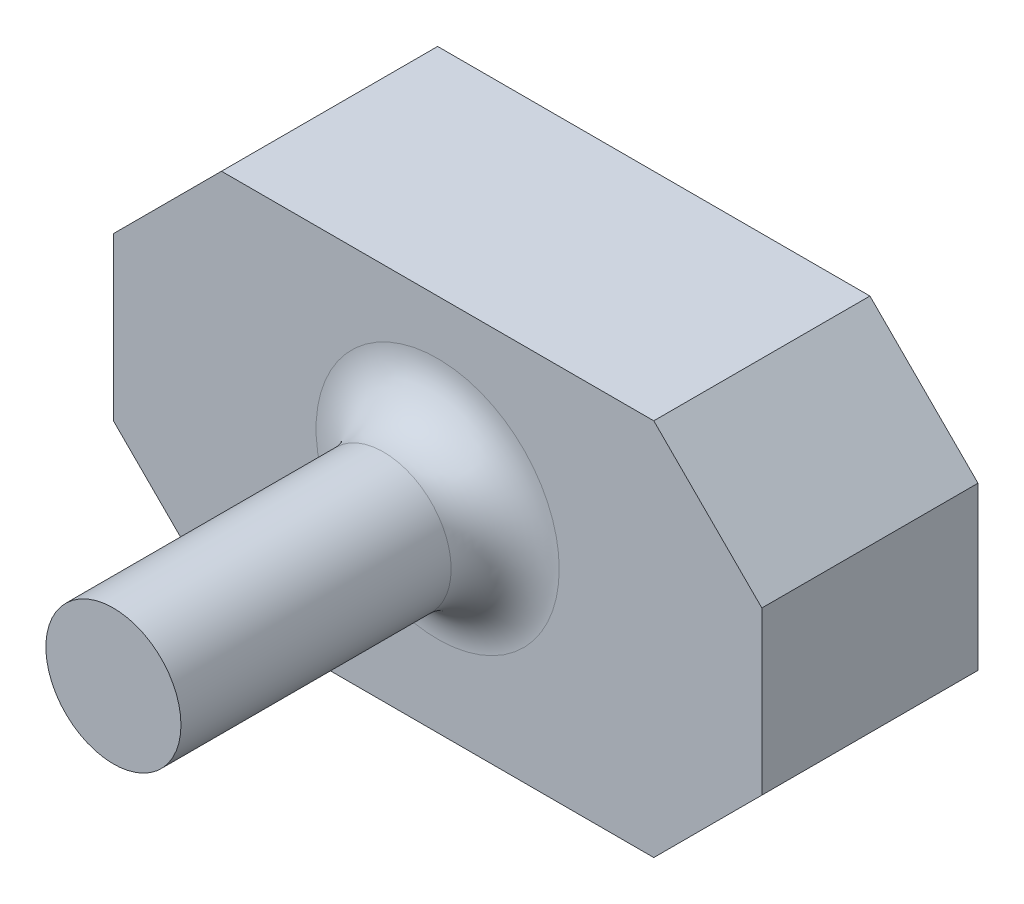
ISO-10303-21;
HEADER;
FILE_DESCRIPTION(('STEP AP214'),'2;1');
FILE_NAME('part.step','',(''),(''),'','','');
FILE_SCHEMA(('AUTOMOTIVE_DESIGN { 1 0 10303 214 1 1 1 1 }'));
ENDSEC;
DATA;
#1=APPLICATION_CONTEXT('core data for automotive mechanical design processes');
#2=APPLICATION_PROTOCOL_DEFINITION('international standard','automotive_design',2000,#1);
#3=PRODUCT_CONTEXT('',#1,'mechanical');
#4=PRODUCT('Part','Part','',(#3));
#5=PRODUCT_RELATED_PRODUCT_CATEGORY('part','',(#4));
#6=PRODUCT_DEFINITION_FORMATION('','',#4);
#7=PRODUCT_DEFINITION_CONTEXT('part definition',#1,'design');
#8=PRODUCT_DEFINITION('design','',#6,#7);
#9=PRODUCT_DEFINITION_SHAPE('','',#8);
#10=(LENGTH_UNIT() NAMED_UNIT(*) SI_UNIT(.MILLI.,.METRE.));
#11=(NAMED_UNIT(*) PLANE_ANGLE_UNIT() SI_UNIT($,.RADIAN.));
#12=(NAMED_UNIT(*) SI_UNIT($,.STERADIAN.) SOLID_ANGLE_UNIT());
#13=UNCERTAINTY_MEASURE_WITH_UNIT(LENGTH_MEASURE(1.E-05),#10,'distance_accuracy_value','');
#14=(GEOMETRIC_REPRESENTATION_CONTEXT(3) GLOBAL_UNCERTAINTY_ASSIGNED_CONTEXT((#13)) GLOBAL_UNIT_ASSIGNED_CONTEXT((#10,
#11,#12)) REPRESENTATION_CONTEXT('',''));
#15=CARTESIAN_POINT('',(0.,0.,0.));
#16=DIRECTION('',(0.,0.,1.));
#17=DIRECTION('',(1.,0.,0.));
#18=AXIS2_PLACEMENT_3D('',#15,#16,#17);
#19=CARTESIAN_POINT('',(0.,95.25,152.4));
#20=DIRECTION('',(0.,0.,-1.));
#21=DIRECTION('',(-1.,0.,0.));
#22=AXIS2_PLACEMENT_3D('',#19,#20,#21);
#23=CYLINDRICAL_SURFACE('',#22,31.75);
#24=CARTESIAN_POINT('',(0.,95.25,25.4));
#25=DIRECTION('',(0.,0.,1.));
#26=DIRECTION('',(1.,0.,0.));
#27=AXIS2_PLACEMENT_3D('',#24,#25,#26);
#28=CIRCLE('',#27,31.75);
#29=CARTESIAN_POINT('',(31.75,95.25,25.4));
#30=VERTEX_POINT('',#29);
#31=EDGE_CURVE('E52',#30,#30,#28,.T.);
#32=ORIENTED_EDGE('',*,*,#31,.T.);
#33=EDGE_LOOP('',(#32));
#34=FACE_BOUND('',#33,.T.);
#35=CARTESIAN_POINT('',(0.,95.25,152.4));
#36=DIRECTION('',(0.,0.,1.));
#37=DIRECTION('',(1.,0.,0.));
#38=AXIS2_PLACEMENT_3D('',#35,#36,#37);
#39=CIRCLE('',#38,31.75);
#40=CARTESIAN_POINT('',(31.75,95.25,152.4));
#41=VERTEX_POINT('',#40);
#42=EDGE_CURVE('E189',#41,#41,#39,.T.);
#43=ORIENTED_EDGE('',*,*,#42,.F.);
#44=EDGE_LOOP('',(#43));
#45=FACE_BOUND('',#44,.T.);
#46=ADVANCED_FACE('F42',(#34,#45),#23,.T.);
#47=CARTESIAN_POINT('',(0.,95.25,152.4));
#48=DIRECTION('',(0.,0.,1.));
#49=DIRECTION('',(1.,0.,0.));
#50=AXIS2_PLACEMENT_3D('',#47,#48,#49);
#51=PLANE('',#50);
#52=ORIENTED_EDGE('',*,*,#42,.T.);
#53=EDGE_LOOP('',(#52));
#54=FACE_BOUND('',#53,.T.);
#55=ADVANCED_FACE('F208',(#54),#51,.T.);
#56=CARTESIAN_POINT('',(-101.6,177.8,-101.6));
#57=DIRECTION('',(0.,-1.,0.));
#58=DIRECTION('',(1.,0.,0.));
#59=AXIS2_PLACEMENT_3D('',#56,#57,#58);
#60=PLANE('',#59);
#61=DIRECTION('',(1.,0.,0.));
#62=VECTOR('',#61,1.);
#63=CARTESIAN_POINT('',(-101.6,177.8,0.));
#64=LINE('',#63,#62);
#65=CARTESIAN_POINT('',(-101.6,177.8,0.));
#66=VERTEX_POINT('',#65);
#67=CARTESIAN_POINT('',(101.6,177.8,0.));
#68=VERTEX_POINT('',#67);
#69=EDGE_CURVE('E145',#66,#68,#64,.T.);
#70=ORIENTED_EDGE('',*,*,#69,.T.);
#71=DIRECTION('',(0.,0.,1.));
#72=VECTOR('',#71,1.);
#73=CARTESIAN_POINT('',(101.6,177.8,-101.6));
#74=LINE('',#73,#72);
#75=CARTESIAN_POINT('',(101.6,177.8,-101.6));
#76=VERTEX_POINT('',#75);
#77=EDGE_CURVE('E186',#76,#68,#74,.T.);
#78=ORIENTED_EDGE('',*,*,#77,.F.);
#79=DIRECTION('',(1.,0.,0.));
#80=VECTOR('',#79,1.);
#81=CARTESIAN_POINT('',(-101.6,177.8,-101.6));
#82=LINE('',#81,#80);
#83=CARTESIAN_POINT('',(-101.6,177.8,-101.6));
#84=VERTEX_POINT('',#83);
#85=EDGE_CURVE('E167',#84,#76,#82,.T.);
#86=ORIENTED_EDGE('',*,*,#85,.F.);
#87=DIRECTION('',(0.,0.,1.));
#88=VECTOR('',#87,1.);
#89=CARTESIAN_POINT('',(-101.6,177.8,-101.6));
#90=LINE('',#89,#88);
#91=EDGE_CURVE('E141',#84,#66,#90,.T.);
#92=ORIENTED_EDGE('',*,*,#91,.T.);
#93=EDGE_LOOP('',(#70,#78,#86,#92));
#94=FACE_BOUND('',#93,.T.);
#95=ADVANCED_FACE('F212',(#94),#60,.F.);
#96=CARTESIAN_POINT('',(101.6,177.8,-101.6));
#97=DIRECTION('',(-0.707106781186548,-0.707106781186547,0.));
#98=DIRECTION('',(0.707106781186547,-0.707106781186548,0.));
#99=AXIS2_PLACEMENT_3D('',#96,#97,#98);
#100=PLANE('',#99);
#101=DIRECTION('',(0.707106781186547,-0.707106781186548,0.));
#102=VECTOR('',#101,1.);
#103=CARTESIAN_POINT('',(101.6,177.8,0.));
#104=LINE('',#103,#102);
#105=CARTESIAN_POINT('',(152.4,127.,0.));
#106=VERTEX_POINT('',#105);
#107=EDGE_CURVE('E149',#68,#106,#104,.T.);
#108=ORIENTED_EDGE('',*,*,#107,.T.);
#109=DIRECTION('',(0.,0.,1.));
#110=VECTOR('',#109,1.);
#111=CARTESIAN_POINT('',(152.4,127.,-101.6));
#112=LINE('',#111,#110);
#113=CARTESIAN_POINT('',(152.4,127.,-101.6));
#114=VERTEX_POINT('',#113);
#115=EDGE_CURVE('E182',#114,#106,#112,.T.);
#116=ORIENTED_EDGE('',*,*,#115,.F.);
#117=DIRECTION('',(0.707106781186547,-0.707106781186548,0.));
#118=VECTOR('',#117,1.);
#119=CARTESIAN_POINT('',(101.6,177.8,-101.6));
#120=LINE('',#119,#118);
#121=EDGE_CURVE('E104',#76,#114,#120,.T.);
#122=ORIENTED_EDGE('',*,*,#121,.F.);
#123=ORIENTED_EDGE('',*,*,#77,.T.);
#124=EDGE_LOOP('',(#108,#116,#122,#123));
#125=FACE_BOUND('',#124,.T.);
#126=ADVANCED_FACE('F218',(#125),#100,.F.);
#127=CARTESIAN_POINT('',(152.4,50.8,-101.6));
#128=DIRECTION('',(-1.,0.,0.));
#129=DIRECTION('',(0.,0.,1.));
#130=AXIS2_PLACEMENT_3D('',#127,#128,#129);
#131=PLANE('',#130);
#132=DIRECTION('',(0.,-1.,0.));
#133=VECTOR('',#132,1.);
#134=CARTESIAN_POINT('',(152.4,50.8,0.));
#135=LINE('',#134,#133);
#136=CARTESIAN_POINT('',(152.4,50.8,0.));
#137=VERTEX_POINT('',#136);
#138=EDGE_CURVE('E152',#106,#137,#135,.T.);
#139=ORIENTED_EDGE('',*,*,#138,.T.);
#140=DIRECTION('',(0.,0.,1.));
#141=VECTOR('',#140,1.);
#142=CARTESIAN_POINT('',(152.4,50.8,-101.6));
#143=LINE('',#142,#141);
#144=CARTESIAN_POINT('',(152.4,50.8,-101.6));
#145=VERTEX_POINT('',#144);
#146=EDGE_CURVE('E178',#145,#137,#143,.T.);
#147=ORIENTED_EDGE('',*,*,#146,.F.);
#148=DIRECTION('',(0.,-1.,0.));
#149=VECTOR('',#148,1.);
#150=CARTESIAN_POINT('',(152.4,50.8,-101.6));
#151=LINE('',#150,#149);
#152=EDGE_CURVE('E353',#114,#145,#151,.T.);
#153=ORIENTED_EDGE('',*,*,#152,.F.);
#154=ORIENTED_EDGE('',*,*,#115,.T.);
#155=EDGE_LOOP('',(#139,#147,#153,#154));
#156=FACE_BOUND('',#155,.T.);
#157=ADVANCED_FACE('F222',(#156),#131,.F.);
#158=CARTESIAN_POINT('',(101.6,0.,-101.6));
#159=DIRECTION('',(-0.707106781186548,0.707106781186548,0.));
#160=DIRECTION('',(-0.707106781186547,-0.707106781186548,0.));
#161=AXIS2_PLACEMENT_3D('',#158,#159,#160);
#162=PLANE('',#161);
#163=DIRECTION('',(-0.707106781186547,-0.707106781186547,0.));
#164=VECTOR('',#163,1.);
#165=CARTESIAN_POINT('',(101.6,0.,0.));
#166=LINE('',#165,#164);
#167=CARTESIAN_POINT('',(101.6,0.,0.));
#168=VERTEX_POINT('',#167);
#169=EDGE_CURVE('E155',#137,#168,#166,.T.);
#170=ORIENTED_EDGE('',*,*,#169,.T.);
#171=DIRECTION('',(0.,0.,1.));
#172=VECTOR('',#171,1.);
#173=CARTESIAN_POINT('',(101.6,0.,-101.6));
#174=LINE('',#173,#172);
#175=CARTESIAN_POINT('',(101.6,0.,-101.6));
#176=VERTEX_POINT('',#175);
#177=EDGE_CURVE('E174',#176,#168,#174,.T.);
#178=ORIENTED_EDGE('',*,*,#177,.F.);
#179=DIRECTION('',(-0.707106781186547,-0.707106781186547,0.));
#180=VECTOR('',#179,1.);
#181=CARTESIAN_POINT('',(101.6,0.,-101.6));
#182=LINE('',#181,#180);
#183=EDGE_CURVE('E358',#145,#176,#182,.T.);
#184=ORIENTED_EDGE('',*,*,#183,.F.);
#185=ORIENTED_EDGE('',*,*,#146,.T.);
#186=EDGE_LOOP('',(#170,#178,#184,#185));
#187=FACE_BOUND('',#186,.T.);
#188=ADVANCED_FACE('F225',(#187),#162,.F.);
#189=CARTESIAN_POINT('',(-101.6,0.,-101.6));
#190=DIRECTION('',(0.,1.,0.));
#191=DIRECTION('',(-1.,0.,0.));
#192=AXIS2_PLACEMENT_3D('',#189,#190,#191);
#193=PLANE('',#192);
#194=DIRECTION('',(-1.,0.,0.));
#195=VECTOR('',#194,1.);
#196=CARTESIAN_POINT('',(-101.6,0.,0.));
#197=LINE('',#196,#195);
#198=CARTESIAN_POINT('',(-101.6,0.,0.));
#199=VERTEX_POINT('',#198);
#200=EDGE_CURVE('E158',#168,#199,#197,.T.);
#201=ORIENTED_EDGE('',*,*,#200,.T.);
#202=DIRECTION('',(0.,0.,1.));
#203=VECTOR('',#202,1.);
#204=CARTESIAN_POINT('',(-101.6,0.,-101.6));
#205=LINE('',#204,#203);
#206=CARTESIAN_POINT('',(-101.6,0.,-101.6));
#207=VERTEX_POINT('',#206);
#208=EDGE_CURVE('E134',#207,#199,#205,.T.);
#209=ORIENTED_EDGE('',*,*,#208,.F.);
#210=DIRECTION('',(-1.,0.,0.));
#211=VECTOR('',#210,1.);
#212=CARTESIAN_POINT('',(-101.6,0.,-101.6));
#213=LINE('',#212,#211);
#214=EDGE_CURVE('E123',#176,#207,#213,.T.);
#215=ORIENTED_EDGE('',*,*,#214,.F.);
#216=ORIENTED_EDGE('',*,*,#177,.T.);
#217=EDGE_LOOP('',(#201,#209,#215,#216));
#218=FACE_BOUND('',#217,.T.);
#219=ADVANCED_FACE('F229',(#218),#193,.F.);
#220=CARTESIAN_POINT('',(-152.4,50.8,-101.6));
#221=DIRECTION('',(0.707106781186548,0.707106781186547,0.));
#222=DIRECTION('',(-0.707106781186547,0.707106781186548,0.));
#223=AXIS2_PLACEMENT_3D('',#220,#221,#222);
#224=PLANE('',#223);
#225=DIRECTION('',(-0.707106781186547,0.707106781186548,0.));
#226=VECTOR('',#225,1.);
#227=CARTESIAN_POINT('',(-152.4,50.8,0.));
#228=LINE('',#227,#226);
#229=CARTESIAN_POINT('',(-152.4,50.8,0.));
#230=VERTEX_POINT('',#229);
#231=EDGE_CURVE('E132',#199,#230,#228,.T.);
#232=ORIENTED_EDGE('',*,*,#231,.T.);
#233=DIRECTION('',(0.,0.,1.));
#234=VECTOR('',#233,1.);
#235=CARTESIAN_POINT('',(-152.4,50.8,-101.6));
#236=LINE('',#235,#234);
#237=CARTESIAN_POINT('',(-152.4,50.8,-101.6));
#238=VERTEX_POINT('',#237);
#239=EDGE_CURVE('E129',#238,#230,#236,.T.);
#240=ORIENTED_EDGE('',*,*,#239,.F.);
#241=DIRECTION('',(-0.707106781186547,0.707106781186548,0.));
#242=VECTOR('',#241,1.);
#243=CARTESIAN_POINT('',(-152.4,50.8,-101.6));
#244=LINE('',#243,#242);
#245=EDGE_CURVE('E117',#207,#238,#244,.T.);
#246=ORIENTED_EDGE('',*,*,#245,.F.);
#247=ORIENTED_EDGE('',*,*,#208,.T.);
#248=EDGE_LOOP('',(#232,#240,#246,#247));
#249=FACE_BOUND('',#248,.T.);
#250=ADVANCED_FACE('F130',(#249),#224,.F.);
#251=CARTESIAN_POINT('',(-152.4,50.8,-101.6));
#252=DIRECTION('',(1.,0.,0.));
#253=DIRECTION('',(0.,0.,-1.));
#254=AXIS2_PLACEMENT_3D('',#251,#252,#253);
#255=PLANE('',#254);
#256=DIRECTION('',(0.,1.,0.));
#257=VECTOR('',#256,1.);
#258=CARTESIAN_POINT('',(-152.4,50.8,0.));
#259=LINE('',#258,#257);
#260=CARTESIAN_POINT('',(-152.4,127.,0.));
#261=VERTEX_POINT('',#260);
#262=EDGE_CURVE('E89',#230,#261,#259,.T.);
#263=ORIENTED_EDGE('',*,*,#262,.T.);
#264=DIRECTION('',(0.,0.,1.));
#265=VECTOR('',#264,1.);
#266=CARTESIAN_POINT('',(-152.4,127.,-101.6));
#267=LINE('',#266,#265);
#268=CARTESIAN_POINT('',(-152.4,127.,-101.6));
#269=VERTEX_POINT('',#268);
#270=EDGE_CURVE('E135',#269,#261,#267,.T.);
#271=ORIENTED_EDGE('',*,*,#270,.F.);
#272=DIRECTION('',(0.,1.,0.));
#273=VECTOR('',#272,1.);
#274=CARTESIAN_POINT('',(-152.4,50.8,-101.6));
#275=LINE('',#274,#273);
#276=EDGE_CURVE('E121',#238,#269,#275,.T.);
#277=ORIENTED_EDGE('',*,*,#276,.F.);
#278=ORIENTED_EDGE('',*,*,#239,.T.);
#279=EDGE_LOOP('',(#263,#271,#277,#278));
#280=FACE_BOUND('',#279,.T.);
#281=ADVANCED_FACE('F137',(#280),#255,.F.);
#282=CARTESIAN_POINT('',(-152.4,127.,-101.6));
#283=DIRECTION('',(0.707106781186547,-0.707106781186548,0.));
#284=DIRECTION('',(0.707106781186548,0.707106781186547,0.));
#285=AXIS2_PLACEMENT_3D('',#282,#283,#284);
#286=PLANE('',#285);
#287=DIRECTION('',(0.707106781186548,0.707106781186547,0.));
#288=VECTOR('',#287,1.);
#289=CARTESIAN_POINT('',(-152.4,127.,0.));
#290=LINE('',#289,#288);
#291=EDGE_CURVE('E95',#261,#66,#290,.T.);
#292=ORIENTED_EDGE('',*,*,#291,.T.);
#293=ORIENTED_EDGE('',*,*,#91,.F.);
#294=DIRECTION('',(0.707106781186548,0.707106781186547,0.));
#295=VECTOR('',#294,1.);
#296=CARTESIAN_POINT('',(-152.4,127.,-101.6));
#297=LINE('',#296,#295);
#298=EDGE_CURVE('E60',#269,#84,#297,.T.);
#299=ORIENTED_EDGE('',*,*,#298,.F.);
#300=ORIENTED_EDGE('',*,*,#270,.T.);
#301=EDGE_LOOP('',(#292,#293,#299,#300));
#302=FACE_BOUND('',#301,.T.);
#303=ADVANCED_FACE('F238',(#302),#286,.F.);
#304=CARTESIAN_POINT('',(0.,0.,-101.6));
#305=DIRECTION('',(0.,0.,1.));
#306=DIRECTION('',(1.,0.,0.));
#307=AXIS2_PLACEMENT_3D('',#304,#305,#306);
#308=PLANE('',#307);
#309=ORIENTED_EDGE('',*,*,#85,.T.);
#310=ORIENTED_EDGE('',*,*,#121,.T.);
#311=ORIENTED_EDGE('',*,*,#152,.T.);
#312=ORIENTED_EDGE('',*,*,#183,.T.);
#313=ORIENTED_EDGE('',*,*,#214,.T.);
#314=ORIENTED_EDGE('',*,*,#245,.T.);
#315=ORIENTED_EDGE('',*,*,#276,.T.);
#316=ORIENTED_EDGE('',*,*,#298,.T.);
#317=EDGE_LOOP('',(#309,#310,#311,#312,#313,#314,#315,#316));
#318=FACE_BOUND('',#317,.T.);
#319=ADVANCED_FACE('F119',(#318),#308,.F.);
#320=CARTESIAN_POINT('',(0.,0.,0.));
#321=DIRECTION('',(0.,0.,1.));
#322=DIRECTION('',(1.,0.,0.));
#323=AXIS2_PLACEMENT_3D('',#320,#321,#322);
#324=PLANE('',#323);
#325=CARTESIAN_POINT('',(0.,95.25,0.));
#326=DIRECTION('',(0.,0.,1.));
#327=DIRECTION('',(1.,0.,0.));
#328=AXIS2_PLACEMENT_3D('',#325,#326,#327);
#329=CIRCLE('',#328,57.15);
#330=CARTESIAN_POINT('',(57.15,95.25,0.));
#331=VERTEX_POINT('',#330);
#332=EDGE_CURVE('E11',#331,#331,#329,.F.);
#333=ORIENTED_EDGE('',*,*,#332,.T.);
#334=EDGE_LOOP('',(#333));
#335=FACE_BOUND('',#334,.T.);
#336=ORIENTED_EDGE('',*,*,#69,.F.);
#337=ORIENTED_EDGE('',*,*,#291,.F.);
#338=ORIENTED_EDGE('',*,*,#262,.F.);
#339=ORIENTED_EDGE('',*,*,#231,.F.);
#340=ORIENTED_EDGE('',*,*,#200,.F.);
#341=ORIENTED_EDGE('',*,*,#169,.F.);
#342=ORIENTED_EDGE('',*,*,#138,.F.);
#343=ORIENTED_EDGE('',*,*,#107,.F.);
#344=EDGE_LOOP('',(#336,#337,#338,#339,#340,#341,#342,#343));
#345=FACE_BOUND('',#344,.T.);
#346=ADVANCED_FACE('F199',(#335,#345),#324,.T.);
#347=CARTESIAN_POINT('',(0.,95.25,25.4));
#348=DIRECTION('',(0.,0.,1.));
#349=DIRECTION('',(1.,0.,0.));
#350=AXIS2_PLACEMENT_3D('',#347,#348,#349);
#351=TOROIDAL_SURFACE('',#350,57.15,25.4);
#352=ORIENTED_EDGE('',*,*,#332,.F.);
#353=EDGE_LOOP('',(#352));
#354=FACE_BOUND('',#353,.T.);
#355=ORIENTED_EDGE('',*,*,#31,.F.);
#356=EDGE_LOOP('',(#355));
#357=FACE_BOUND('',#356,.T.);
#358=ADVANCED_FACE('F44',(#354,#357),#351,.F.);
#359=CLOSED_SHELL('',(#46,#55,#95,#126,#157,#188,#219,#250,#281,#303,#319,#346,#358));
#360=MANIFOLD_SOLID_BREP('B2',#359);
#361=ADVANCED_BREP_SHAPE_REPRESENTATION('',(#18,#360),#14);
#362=SHAPE_DEFINITION_REPRESENTATION(#9,#361);
ENDSEC;
END-ISO-10303-21;
